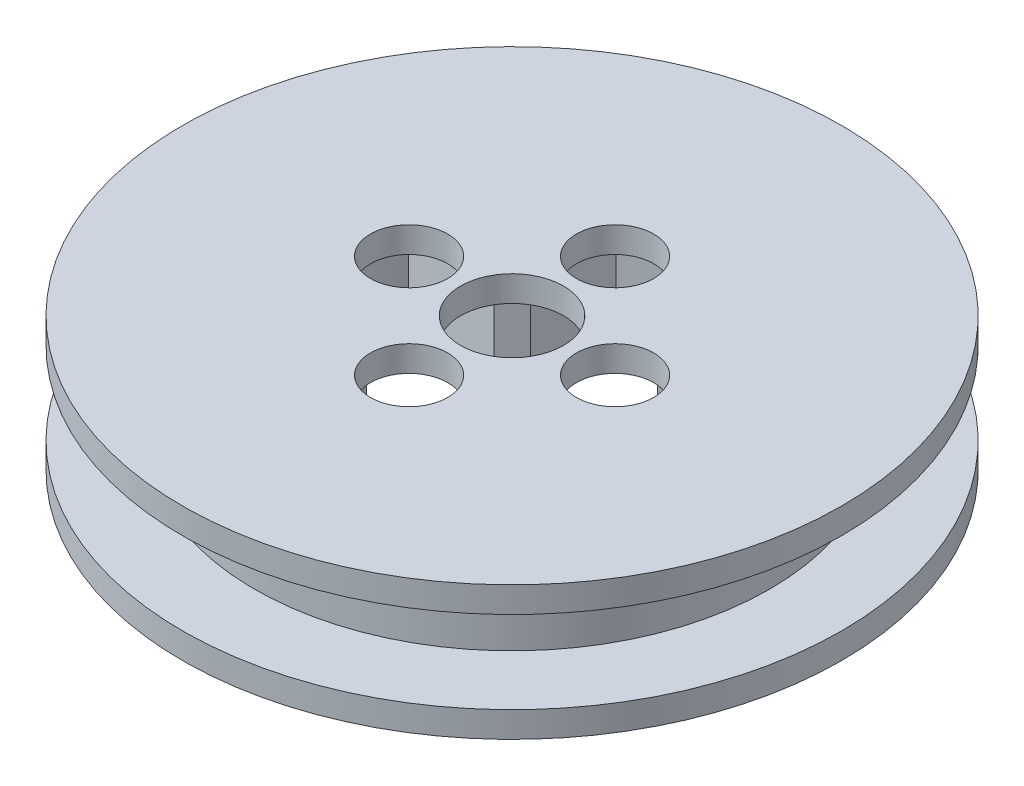
ISO-10303-21;
HEADER;
FILE_DESCRIPTION(('STEP AP214'),'2;1');
FILE_NAME('part.step','',(''),(''),'','','');
FILE_SCHEMA(('AUTOMOTIVE_DESIGN { 1 0 10303 214 1 1 1 1 }'));
ENDSEC;
DATA;
#1=APPLICATION_CONTEXT('core data for automotive mechanical design processes');
#2=APPLICATION_PROTOCOL_DEFINITION('international standard','automotive_design',2000,#1);
#3=PRODUCT_CONTEXT('',#1,'mechanical');
#4=PRODUCT('Part','Part','',(#3));
#5=PRODUCT_RELATED_PRODUCT_CATEGORY('part','',(#4));
#6=PRODUCT_DEFINITION_FORMATION('','',#4);
#7=PRODUCT_DEFINITION_CONTEXT('part definition',#1,'design');
#8=PRODUCT_DEFINITION('design','',#6,#7);
#9=PRODUCT_DEFINITION_SHAPE('','',#8);
#10=(LENGTH_UNIT() NAMED_UNIT(*) SI_UNIT(.MILLI.,.METRE.));
#11=(NAMED_UNIT(*) PLANE_ANGLE_UNIT() SI_UNIT($,.RADIAN.));
#12=(NAMED_UNIT(*) SI_UNIT($,.STERADIAN.) SOLID_ANGLE_UNIT());
#13=UNCERTAINTY_MEASURE_WITH_UNIT(LENGTH_MEASURE(1.E-05),#10,'distance_accuracy_value','');
#14=(GEOMETRIC_REPRESENTATION_CONTEXT(3) GLOBAL_UNCERTAINTY_ASSIGNED_CONTEXT((#13)) GLOBAL_UNIT_ASSIGNED_CONTEXT((#10,
#11,#12)) REPRESENTATION_CONTEXT('',''));
#15=CARTESIAN_POINT('',(0.,0.,0.));
#16=DIRECTION('',(0.,0.,1.));
#17=DIRECTION('',(1.,0.,0.));
#18=AXIS2_PLACEMENT_3D('',#15,#16,#17);
#19=CARTESIAN_POINT('',(64.8025652840579,-6.22836410779435,12.446906686032));
#20=DIRECTION('',(0.,-1.,0.));
#21=DIRECTION('',(1.,0.,0.));
#22=AXIS2_PLACEMENT_3D('',#19,#20,#21);
#23=PLANE('',#22);
#24=CARTESIAN_POINT('',(64.8025652840579,-6.22836410779435,12.446906686032));
#25=DIRECTION('',(0.,-1.,0.));
#26=DIRECTION('',(1.,0.,0.));
#27=AXIS2_PLACEMENT_3D('',#24,#25,#26);
#28=CIRCLE('',#27,3.175);
#29=CARTESIAN_POINT('',(67.9775652840579,-6.22836410779435,12.446906686032));
#30=VERTEX_POINT('',#29);
#31=EDGE_CURVE('E289',#30,#30,#28,.T.);
#32=ORIENTED_EDGE('',*,*,#31,.F.);
#33=EDGE_LOOP('',(#32));
#34=FACE_BOUND('',#33,.T.);
#35=CARTESIAN_POINT('',(64.8025652840579,-6.22836410779435,18.796906686032));
#36=DIRECTION('',(0.,-1.,0.));
#37=DIRECTION('',(1.,0.,0.));
#38=AXIS2_PLACEMENT_3D('',#35,#36,#37);
#39=CIRCLE('',#38,2.38125000000001);
#40=CARTESIAN_POINT('',(67.1838152840579,-6.22836410779435,18.796906686032));
#41=VERTEX_POINT('',#40);
#42=EDGE_CURVE('E301',#41,#41,#39,.T.);
#43=ORIENTED_EDGE('',*,*,#42,.F.);
#44=EDGE_LOOP('',(#43));
#45=FACE_BOUND('',#44,.T.);
#46=CARTESIAN_POINT('',(58.4525652840579,-6.22836410779435,12.446906686032));
#47=DIRECTION('',(0.,-1.,0.));
#48=DIRECTION('',(1.,0.,0.));
#49=AXIS2_PLACEMENT_3D('',#46,#47,#48);
#50=CIRCLE('',#49,2.38125);
#51=CARTESIAN_POINT('',(60.8338152840579,-6.22836410779435,12.446906686032));
#52=VERTEX_POINT('',#51);
#53=EDGE_CURVE('E313',#52,#52,#50,.T.);
#54=ORIENTED_EDGE('',*,*,#53,.F.);
#55=EDGE_LOOP('',(#54));
#56=FACE_BOUND('',#55,.T.);
#57=CARTESIAN_POINT('',(71.1525652840579,-6.22836410779435,12.446906686032));
#58=DIRECTION('',(0.,-1.,0.));
#59=DIRECTION('',(1.,0.,0.));
#60=AXIS2_PLACEMENT_3D('',#57,#58,#59);
#61=CIRCLE('',#60,2.38125000000001);
#62=CARTESIAN_POINT('',(73.5338152840579,-6.22836410779435,12.446906686032));
#63=VERTEX_POINT('',#62);
#64=EDGE_CURVE('E307',#63,#63,#61,.T.);
#65=ORIENTED_EDGE('',*,*,#64,.F.);
#66=EDGE_LOOP('',(#65));
#67=FACE_BOUND('',#66,.T.);
#68=CARTESIAN_POINT('',(64.8025652840579,-6.22836410779435,6.09690668603199));
#69=DIRECTION('',(0.,-1.,0.));
#70=DIRECTION('',(1.,0.,0.));
#71=AXIS2_PLACEMENT_3D('',#68,#69,#70);
#72=CIRCLE('',#71,2.38125000000001);
#73=CARTESIAN_POINT('',(67.1838152840579,-6.22836410779435,6.09690668603199));
#74=VERTEX_POINT('',#73);
#75=EDGE_CURVE('E295',#74,#74,#72,.T.);
#76=ORIENTED_EDGE('',*,*,#75,.F.);
#77=EDGE_LOOP('',(#76));
#78=FACE_BOUND('',#77,.T.);
#79=DIRECTION('',(-0.70710678118655,0.,0.707106781186545));
#80=VECTOR('',#79,1.);
#81=CARTESIAN_POINT('',(60.8737032310902,-6.22836410779435,7.39551261793057));
#82=LINE('',#81,#80);
#83=CARTESIAN_POINT('',(60.8737032310902,-6.22836410779435,7.39551261793057));
#84=VERTEX_POINT('',#83);
#85=CARTESIAN_POINT('',(59.7511712159565,-6.22836410779435,8.5180446330642));
#86=VERTEX_POINT('',#85);
#87=EDGE_CURVE('E54',#84,#86,#82,.T.);
#88=ORIENTED_EDGE('',*,*,#87,.F.);
#89=DIRECTION('',(0.258819045102516,0.,0.96592582628907));
#90=VECTOR('',#89,1.);
#91=CARTESIAN_POINT('',(58.94207584145,-6.22836410779435,0.186581058501487));
#92=LINE('',#91,#90);
#93=CARTESIAN_POINT('',(58.94207584145,-6.22836410779435,0.186581058501485));
#94=VERTEX_POINT('',#93);
#95=EDGE_CURVE('E176',#94,#84,#92,.T.);
#96=ORIENTED_EDGE('',*,*,#95,.F.);
#97=CARTESIAN_POINT('',(64.8025652840579,-6.22836410779435,12.446906686032));
#98=DIRECTION('',(0.,-1.,0.));
#99=DIRECTION('',(1.,0.,0.));
#100=AXIS2_PLACEMENT_3D('',#97,#98,#99);
#101=CIRCLE('',#100,13.589);
#102=CARTESIAN_POINT('',(70.663054726666,-6.22836410779435,0.186581058501565));
#103=VERTEX_POINT('',#102);
#104=EDGE_CURVE('E285',#94,#103,#101,.T.);
#105=ORIENTED_EDGE('',*,*,#104,.T.);
#106=DIRECTION('',(0.258819045102529,0.,-0.965925826289066));
#107=VECTOR('',#106,1.);
#108=CARTESIAN_POINT('',(68.7314273370257,-6.22836410779435,7.39551261793062));
#109=LINE('',#108,#107);
#110=CARTESIAN_POINT('',(68.7314273370257,-6.22836410779435,7.39551261793062));
#111=VERTEX_POINT('',#110);
#112=EDGE_CURVE('E185',#111,#103,#109,.T.);
#113=ORIENTED_EDGE('',*,*,#112,.F.);
#114=DIRECTION('',(-0.707106781186551,0.,-0.707106781186544));
#115=VECTOR('',#114,1.);
#116=CARTESIAN_POINT('',(69.8539593521593,-6.22836410779435,8.51804463306426));
#117=LINE('',#116,#115);
#118=CARTESIAN_POINT('',(69.8539593521593,-6.22836410779435,8.51804463306426));
#119=VERTEX_POINT('',#118);
#120=EDGE_CURVE('E190',#119,#111,#117,.T.);
#121=ORIENTED_EDGE('',*,*,#120,.F.);
#122=DIRECTION('',(-0.965925826289069,0.,0.258819045102517));
#123=VECTOR('',#122,1.);
#124=CARTESIAN_POINT('',(77.0628909115884,-6.22836410779435,6.58641724342404));
#125=LINE('',#124,#123);
#126=CARTESIAN_POINT('',(77.0628909115884,-6.22836410779435,6.58641724342405));
#127=VERTEX_POINT('',#126);
#128=EDGE_CURVE('E194',#127,#119,#125,.T.);
#129=ORIENTED_EDGE('',*,*,#128,.F.);
#130=CARTESIAN_POINT('',(77.0628909115883,-6.22836410779435,18.3073961286401));
#131=VERTEX_POINT('',#130);
#132=EDGE_CURVE('E634',#127,#131,#101,.T.);
#133=ORIENTED_EDGE('',*,*,#132,.T.);
#134=DIRECTION('',(0.965925826289067,0.,0.258819045102527));
#135=VECTOR('',#134,1.);
#136=CARTESIAN_POINT('',(69.8539593521593,-6.22836410779435,16.3757687389998));
#137=LINE('',#136,#135);
#138=CARTESIAN_POINT('',(69.8539593521593,-6.22836410779435,16.3757687389998));
#139=VERTEX_POINT('',#138);
#140=EDGE_CURVE('E212',#139,#131,#137,.T.);
#141=ORIENTED_EDGE('',*,*,#140,.F.);
#142=DIRECTION('',(0.707106781186547,0.,-0.707106781186547));
#143=VECTOR('',#142,1.);
#144=CARTESIAN_POINT('',(68.7314273370256,-6.22836410779435,17.4983007541334));
#145=LINE('',#144,#143);
#146=CARTESIAN_POINT('',(68.7314273370256,-6.22836410779435,17.4983007541334));
#147=VERTEX_POINT('',#146);
#148=EDGE_CURVE('E217',#147,#139,#145,.T.);
#149=ORIENTED_EDGE('',*,*,#148,.F.);
#150=DIRECTION('',(-0.258819045102516,0.,-0.96592582628907));
#151=VECTOR('',#150,1.);
#152=CARTESIAN_POINT('',(70.6630547266658,-6.22836410779435,24.7072323135625));
#153=LINE('',#152,#151);
#154=CARTESIAN_POINT('',(70.6630547266658,-6.22836410779435,24.7072323135625));
#155=VERTEX_POINT('',#154);
#156=EDGE_CURVE('E221',#155,#147,#153,.T.);
#157=ORIENTED_EDGE('',*,*,#156,.F.);
#158=CARTESIAN_POINT('',(58.9420758414498,-6.22836410779435,24.7072323135624));
#159=VERTEX_POINT('',#158);
#160=EDGE_CURVE('E279',#155,#159,#101,.T.);
#161=ORIENTED_EDGE('',*,*,#160,.T.);
#162=DIRECTION('',(-0.258819045102528,0.,0.965925826289066));
#163=VECTOR('',#162,1.);
#164=CARTESIAN_POINT('',(60.8737032310901,-6.22836410779435,17.4983007541334));
#165=LINE('',#164,#163);
#166=CARTESIAN_POINT('',(60.8737032310901,-6.22836410779435,17.4983007541334));
#167=VERTEX_POINT('',#166);
#168=EDGE_CURVE('E242',#167,#159,#165,.T.);
#169=ORIENTED_EDGE('',*,*,#168,.F.);
#170=DIRECTION('',(0.707106781186544,0.,0.707106781186551));
#171=VECTOR('',#170,1.);
#172=CARTESIAN_POINT('',(59.7511712159565,-6.22836410779435,16.3757687389997));
#173=LINE('',#172,#171);
#174=CARTESIAN_POINT('',(59.7511712159565,-6.22836410779435,16.3757687389997));
#175=VERTEX_POINT('',#174);
#176=EDGE_CURVE('E247',#175,#167,#173,.T.);
#177=ORIENTED_EDGE('',*,*,#176,.F.);
#178=DIRECTION('',(0.965925826289069,0.,-0.258819045102517));
#179=VECTOR('',#178,1.);
#180=CARTESIAN_POINT('',(52.5422396565274,-6.22836410779435,18.3073961286399));
#181=LINE('',#180,#179);
#182=CARTESIAN_POINT('',(52.5422396565274,-6.22836410779435,18.3073961286399));
#183=VERTEX_POINT('',#182);
#184=EDGE_CURVE('E251',#183,#175,#181,.T.);
#185=ORIENTED_EDGE('',*,*,#184,.F.);
#186=CARTESIAN_POINT('',(52.5422396565275,-6.22836410779435,6.58641724342388));
#187=VERTEX_POINT('',#186);
#188=EDGE_CURVE('E282',#183,#187,#101,.T.);
#189=ORIENTED_EDGE('',*,*,#188,.T.);
#190=DIRECTION('',(-0.965925826289066,0.,-0.258819045102528));
#191=VECTOR('',#190,1.);
#192=CARTESIAN_POINT('',(59.7511712159565,-6.22836410779435,8.5180446330642));
#193=LINE('',#192,#191);
#194=EDGE_CURVE('E59',#86,#187,#193,.T.);
#195=ORIENTED_EDGE('',*,*,#194,.F.);
#196=EDGE_LOOP('',(#88,#96,#105,#113,#121,#129,#133,#141,#149,#157,#161,#169,#177,#185,#189,#195));
#197=FACE_BOUND('',#196,.T.);
#198=ADVANCED_FACE('F37',(#34,#45,#56,#67,#78,#197),#23,.T.);
#199=CARTESIAN_POINT('',(64.8025652840579,-11.3083641077944,12.446906686032));
#200=DIRECTION('',(0.,1.,0.));
#201=DIRECTION('',(-1.,0.,0.));
#202=AXIS2_PLACEMENT_3D('',#199,#200,#201);
#203=CYLINDRICAL_SURFACE('',#202,13.589);
#204=ORIENTED_EDGE('',*,*,#104,.F.);
#205=DIRECTION('',(0.,1.,0.));
#206=VECTOR('',#205,1.);
#207=CARTESIAN_POINT('',(58.94207584145,-24.6783328893584,0.186581058501487));
#208=LINE('',#207,#206);
#209=CARTESIAN_POINT('',(58.94207584145,-12.8958641077944,0.186581058501487));
#210=VERTEX_POINT('',#209);
#211=EDGE_CURVE('E179',#210,#94,#208,.T.);
#212=ORIENTED_EDGE('',*,*,#211,.F.);
#213=CARTESIAN_POINT('',(64.8025652840579,-12.8958641077944,12.446906686032));
#214=DIRECTION('',(0.,-1.,0.));
#215=DIRECTION('',(1.,0.,0.));
#216=AXIS2_PLACEMENT_3D('',#213,#214,#215);
#217=CIRCLE('',#216,13.589);
#218=CARTESIAN_POINT('',(70.663054726666,-12.8958641077944,0.186581058501561));
#219=VERTEX_POINT('',#218);
#220=EDGE_CURVE('E275',#210,#219,#217,.T.);
#221=ORIENTED_EDGE('',*,*,#220,.T.);
#222=DIRECTION('',(0.,1.,0.));
#223=VECTOR('',#222,1.);
#224=CARTESIAN_POINT('',(70.663054726666,-24.6783328893584,0.186581058501573));
#225=LINE('',#224,#223);
#226=EDGE_CURVE('E169',#219,#103,#225,.T.);
#227=ORIENTED_EDGE('',*,*,#226,.T.);
#228=EDGE_LOOP('',(#204,#212,#221,#227));
#229=FACE_BOUND('',#228,.T.);
#230=ADVANCED_FACE('F354',(#229),#203,.F.);
#231=CARTESIAN_POINT('',(52.5422396565274,-12.8958641077944,18.3073961286399));
#232=VERTEX_POINT('',#231);
#233=CARTESIAN_POINT('',(52.5422396565275,-12.8958641077944,6.58641724342389));
#234=VERTEX_POINT('',#233);
#235=EDGE_CURVE('E272',#232,#234,#217,.T.);
#236=ORIENTED_EDGE('',*,*,#235,.T.);
#237=DIRECTION('',(0.,1.,0.));
#238=VECTOR('',#237,1.);
#239=CARTESIAN_POINT('',(52.5422396565275,-24.6783328893584,6.58641724342389));
#240=LINE('',#239,#238);
#241=EDGE_CURVE('E162',#234,#187,#240,.T.);
#242=ORIENTED_EDGE('',*,*,#241,.T.);
#243=ORIENTED_EDGE('',*,*,#188,.F.);
#244=DIRECTION('',(0.,1.,0.));
#245=VECTOR('',#244,1.);
#246=CARTESIAN_POINT('',(52.5422396565274,-24.6783328893584,18.3073961286399));
#247=LINE('',#246,#245);
#248=EDGE_CURVE('E254',#232,#183,#247,.T.);
#249=ORIENTED_EDGE('',*,*,#248,.F.);
#250=EDGE_LOOP('',(#236,#242,#243,#249));
#251=FACE_BOUND('',#250,.T.);
#252=ADVANCED_FACE('F360',(#251),#203,.F.);
#253=ORIENTED_EDGE('',*,*,#132,.F.);
#254=DIRECTION('',(0.,1.,0.));
#255=VECTOR('',#254,1.);
#256=CARTESIAN_POINT('',(77.0628909115884,-24.6783328893584,6.58641724342404));
#257=LINE('',#256,#255);
#258=CARTESIAN_POINT('',(77.0628909115884,-12.8958641077944,6.58641724342404));
#259=VERTEX_POINT('',#258);
#260=EDGE_CURVE('E172',#259,#127,#257,.T.);
#261=ORIENTED_EDGE('',*,*,#260,.F.);
#262=CARTESIAN_POINT('',(77.0628909115883,-12.8958641077944,18.3073961286401));
#263=VERTEX_POINT('',#262);
#264=EDGE_CURVE('E628',#259,#263,#217,.T.);
#265=ORIENTED_EDGE('',*,*,#264,.T.);
#266=DIRECTION('',(0.,1.,0.));
#267=VECTOR('',#266,1.);
#268=CARTESIAN_POINT('',(77.0628909115883,-24.6783328893584,18.3073961286401));
#269=LINE('',#268,#267);
#270=EDGE_CURVE('E200',#263,#131,#269,.T.);
#271=ORIENTED_EDGE('',*,*,#270,.T.);
#272=EDGE_LOOP('',(#253,#261,#265,#271));
#273=FACE_BOUND('',#272,.T.);
#274=ADVANCED_FACE('F372',(#273),#203,.F.);
#275=ORIENTED_EDGE('',*,*,#160,.F.);
#276=DIRECTION('',(0.,1.,0.));
#277=VECTOR('',#276,1.);
#278=CARTESIAN_POINT('',(70.6630547266658,-24.6783328893584,24.7072323135625));
#279=LINE('',#278,#277);
#280=CARTESIAN_POINT('',(70.6630547266658,-12.8958641077944,24.7072323135625));
#281=VERTEX_POINT('',#280);
#282=EDGE_CURVE('E224',#281,#155,#279,.T.);
#283=ORIENTED_EDGE('',*,*,#282,.F.);
#284=CARTESIAN_POINT('',(58.9420758414498,-12.8958641077944,24.7072323135624));
#285=VERTEX_POINT('',#284);
#286=EDGE_CURVE('E258',#281,#285,#217,.T.);
#287=ORIENTED_EDGE('',*,*,#286,.T.);
#288=DIRECTION('',(0.,1.,0.));
#289=VECTOR('',#288,1.);
#290=CARTESIAN_POINT('',(58.9420758414498,-24.6783328893584,24.7072323135624));
#291=LINE('',#290,#289);
#292=EDGE_CURVE('E228',#285,#159,#291,.T.);
#293=ORIENTED_EDGE('',*,*,#292,.T.);
#294=EDGE_LOOP('',(#275,#283,#287,#293));
#295=FACE_BOUND('',#294,.T.);
#296=ADVANCED_FACE('F363',(#295),#203,.F.);
#297=CARTESIAN_POINT('',(64.8025652840579,-6.22836410779435,12.446906686032));
#298=DIRECTION('',(0.,-1.,0.));
#299=DIRECTION('',(1.,0.,0.));
#300=AXIS2_PLACEMENT_3D('',#297,#298,#299);
#301=CIRCLE('',#300,15.875);
#302=CARTESIAN_POINT('',(80.6775652840579,-6.22836410779435,12.446906686032));
#303=VERTEX_POINT('',#302);
#304=EDGE_CURVE('E11',#303,#303,#301,.T.);
#305=ORIENTED_EDGE('',*,*,#304,.F.);
#306=EDGE_LOOP('',(#305));
#307=FACE_BOUND('',#306,.T.);
#308=CARTESIAN_POINT('',(64.8025652840579,-6.22836410779435,12.446906686032));
#309=DIRECTION('',(0.,-1.,0.));
#310=DIRECTION('',(1.,0.,0.));
#311=AXIS2_PLACEMENT_3D('',#308,#309,#310);
#312=CIRCLE('',#311,20.32);
#313=CARTESIAN_POINT('',(85.1225652840579,-6.22836410779435,12.446906686032));
#314=VERTEX_POINT('',#313);
#315=EDGE_CURVE('E46',#314,#314,#312,.T.);
#316=ORIENTED_EDGE('',*,*,#315,.T.);
#317=EDGE_LOOP('',(#316));
#318=FACE_BOUND('',#317,.T.);
#319=ADVANCED_FACE('F327',(#307,#318),#23,.T.);
#320=CARTESIAN_POINT('',(64.8025652840579,-4.64086410779435,12.446906686032));
#321=DIRECTION('',(0.,-1.,0.));
#322=DIRECTION('',(1.,0.,0.));
#323=AXIS2_PLACEMENT_3D('',#320,#321,#322);
#324=PLANE('',#323);
#325=CARTESIAN_POINT('',(64.8025652840579,-4.64086410779435,12.446906686032));
#326=DIRECTION('',(0.,-1.,0.));
#327=DIRECTION('',(1.,0.,0.));
#328=AXIS2_PLACEMENT_3D('',#325,#326,#327);
#329=CIRCLE('',#328,20.32);
#330=CARTESIAN_POINT('',(85.1225652840579,-4.64086410779435,12.446906686032));
#331=VERTEX_POINT('',#330);
#332=EDGE_CURVE('E41',#331,#331,#329,.T.);
#333=ORIENTED_EDGE('',*,*,#332,.F.);
#334=EDGE_LOOP('',(#333));
#335=FACE_BOUND('',#334,.T.);
#336=CARTESIAN_POINT('',(58.4525652840579,-4.64086410779435,12.446906686032));
#337=DIRECTION('',(0.,-1.,0.));
#338=DIRECTION('',(1.,0.,0.));
#339=AXIS2_PLACEMENT_3D('',#336,#337,#338);
#340=CIRCLE('',#339,2.38125);
#341=CARTESIAN_POINT('',(60.8338152840579,-4.64086410779435,12.446906686032));
#342=VERTEX_POINT('',#341);
#343=EDGE_CURVE('E310',#342,#342,#340,.T.);
#344=ORIENTED_EDGE('',*,*,#343,.T.);
#345=EDGE_LOOP('',(#344));
#346=FACE_BOUND('',#345,.T.);
#347=CARTESIAN_POINT('',(71.1525652840579,-4.64086410779435,12.446906686032));
#348=DIRECTION('',(0.,-1.,0.));
#349=DIRECTION('',(1.,0.,0.));
#350=AXIS2_PLACEMENT_3D('',#347,#348,#349);
#351=CIRCLE('',#350,2.38125000000001);
#352=CARTESIAN_POINT('',(73.5338152840579,-4.64086410779435,12.446906686032));
#353=VERTEX_POINT('',#352);
#354=EDGE_CURVE('E304',#353,#353,#351,.T.);
#355=ORIENTED_EDGE('',*,*,#354,.T.);
#356=EDGE_LOOP('',(#355));
#357=FACE_BOUND('',#356,.T.);
#358=CARTESIAN_POINT('',(64.8025652840579,-4.64086410779435,18.796906686032));
#359=DIRECTION('',(0.,-1.,0.));
#360=DIRECTION('',(1.,0.,0.));
#361=AXIS2_PLACEMENT_3D('',#358,#359,#360);
#362=CIRCLE('',#361,2.38125000000001);
#363=CARTESIAN_POINT('',(67.1838152840579,-4.64086410779435,18.796906686032));
#364=VERTEX_POINT('',#363);
#365=EDGE_CURVE('E298',#364,#364,#362,.T.);
#366=ORIENTED_EDGE('',*,*,#365,.T.);
#367=EDGE_LOOP('',(#366));
#368=FACE_BOUND('',#367,.T.);
#369=CARTESIAN_POINT('',(64.8025652840579,-4.64086410779435,6.09690668603199));
#370=DIRECTION('',(0.,-1.,0.));
#371=DIRECTION('',(1.,0.,0.));
#372=AXIS2_PLACEMENT_3D('',#369,#370,#371);
#373=CIRCLE('',#372,2.38125000000001);
#374=CARTESIAN_POINT('',(67.1838152840579,-4.64086410779435,6.09690668603199));
#375=VERTEX_POINT('',#374);
#376=EDGE_CURVE('E292',#375,#375,#373,.T.);
#377=ORIENTED_EDGE('',*,*,#376,.T.);
#378=EDGE_LOOP('',(#377));
#379=FACE_BOUND('',#378,.T.);
#380=CARTESIAN_POINT('',(64.8025652840579,-4.64086410779435,12.446906686032));
#381=DIRECTION('',(0.,-1.,0.));
#382=DIRECTION('',(1.,0.,0.));
#383=AXIS2_PLACEMENT_3D('',#380,#381,#382);
#384=CIRCLE('',#383,3.175);
#385=CARTESIAN_POINT('',(67.9775652840579,-4.64086410779435,12.446906686032));
#386=VERTEX_POINT('',#385);
#387=EDGE_CURVE('E287',#386,#386,#384,.T.);
#388=ORIENTED_EDGE('',*,*,#387,.T.);
#389=EDGE_LOOP('',(#388));
#390=FACE_BOUND('',#389,.T.);
#391=ADVANCED_FACE('F324',(#335,#346,#357,#368,#379,#390),#324,.F.);
#392=CARTESIAN_POINT('',(64.8025652840579,-6.22836410779435,12.446906686032));
#393=DIRECTION('',(0.,1.,0.));
#394=DIRECTION('',(-1.,0.,0.));
#395=AXIS2_PLACEMENT_3D('',#392,#393,#394);
#396=CYLINDRICAL_SURFACE('',#395,20.32);
#397=ORIENTED_EDGE('',*,*,#315,.F.);
#398=EDGE_LOOP('',(#397));
#399=FACE_BOUND('',#398,.T.);
#400=ORIENTED_EDGE('',*,*,#332,.T.);
#401=EDGE_LOOP('',(#400));
#402=FACE_BOUND('',#401,.T.);
#403=ADVANCED_FACE('F39',(#399,#402),#396,.T.);
#404=CARTESIAN_POINT('',(58.4525652840579,-6.22836410779435,12.446906686032));
#405=DIRECTION('',(0.,1.,0.));
#406=DIRECTION('',(-1.,0.,0.));
#407=AXIS2_PLACEMENT_3D('',#404,#405,#406);
#408=CYLINDRICAL_SURFACE('',#407,2.38125);
#409=ORIENTED_EDGE('',*,*,#53,.T.);
#410=EDGE_LOOP('',(#409));
#411=FACE_BOUND('',#410,.T.);
#412=ORIENTED_EDGE('',*,*,#343,.F.);
#413=EDGE_LOOP('',(#412));
#414=FACE_BOUND('',#413,.T.);
#415=ADVANCED_FACE('F533',(#411,#414),#408,.F.);
#416=CARTESIAN_POINT('',(71.1525652840579,-6.22836410779435,12.446906686032));
#417=DIRECTION('',(0.,1.,0.));
#418=DIRECTION('',(-1.,0.,0.));
#419=AXIS2_PLACEMENT_3D('',#416,#417,#418);
#420=CYLINDRICAL_SURFACE('',#419,2.38125000000001);
#421=ORIENTED_EDGE('',*,*,#64,.T.);
#422=EDGE_LOOP('',(#421));
#423=FACE_BOUND('',#422,.T.);
#424=ORIENTED_EDGE('',*,*,#354,.F.);
#425=EDGE_LOOP('',(#424));
#426=FACE_BOUND('',#425,.T.);
#427=ADVANCED_FACE('F523',(#423,#426),#420,.F.);
#428=CARTESIAN_POINT('',(64.8025652840579,-6.22836410779435,18.796906686032));
#429=DIRECTION('',(0.,1.,0.));
#430=DIRECTION('',(-1.,0.,0.));
#431=AXIS2_PLACEMENT_3D('',#428,#429,#430);
#432=CYLINDRICAL_SURFACE('',#431,2.38125000000001);
#433=ORIENTED_EDGE('',*,*,#42,.T.);
#434=EDGE_LOOP('',(#433));
#435=FACE_BOUND('',#434,.T.);
#436=ORIENTED_EDGE('',*,*,#365,.F.);
#437=EDGE_LOOP('',(#436));
#438=FACE_BOUND('',#437,.T.);
#439=ADVANCED_FACE('F350',(#435,#438),#432,.F.);
#440=CARTESIAN_POINT('',(64.8025652840579,-6.22836410779435,6.09690668603199));
#441=DIRECTION('',(0.,1.,0.));
#442=DIRECTION('',(-1.,0.,0.));
#443=AXIS2_PLACEMENT_3D('',#440,#441,#442);
#444=CYLINDRICAL_SURFACE('',#443,2.38125000000001);
#445=ORIENTED_EDGE('',*,*,#75,.T.);
#446=EDGE_LOOP('',(#445));
#447=FACE_BOUND('',#446,.T.);
#448=ORIENTED_EDGE('',*,*,#376,.F.);
#449=EDGE_LOOP('',(#448));
#450=FACE_BOUND('',#449,.T.);
#451=ADVANCED_FACE('F341',(#447,#450),#444,.F.);
#452=CARTESIAN_POINT('',(64.8025652840579,-6.22836410779435,12.446906686032));
#453=DIRECTION('',(0.,1.,0.));
#454=DIRECTION('',(-1.,0.,0.));
#455=AXIS2_PLACEMENT_3D('',#452,#453,#454);
#456=CYLINDRICAL_SURFACE('',#455,3.175);
#457=ORIENTED_EDGE('',*,*,#31,.T.);
#458=EDGE_LOOP('',(#457));
#459=FACE_BOUND('',#458,.T.);
#460=ORIENTED_EDGE('',*,*,#387,.F.);
#461=EDGE_LOOP('',(#460));
#462=FACE_BOUND('',#461,.T.);
#463=ADVANCED_FACE('F338',(#459,#462),#456,.F.);
#464=CARTESIAN_POINT('',(64.8025652840579,-11.3083641077944,12.446906686032));
#465=DIRECTION('',(0.,1.,0.));
#466=DIRECTION('',(-1.,0.,0.));
#467=AXIS2_PLACEMENT_3D('',#464,#465,#466);
#468=CYLINDRICAL_SURFACE('',#467,15.875);
#469=CARTESIAN_POINT('',(64.8025652840579,-11.3083641077944,12.446906686032));
#470=DIRECTION('',(0.,-1.,0.));
#471=DIRECTION('',(1.,0.,0.));
#472=AXIS2_PLACEMENT_3D('',#469,#470,#471);
#473=CIRCLE('',#472,15.875);
#474=CARTESIAN_POINT('',(80.6775652840579,-11.3083641077944,12.446906686032));
#475=VERTEX_POINT('',#474);
#476=EDGE_CURVE('E284',#475,#475,#473,.T.);
#477=ORIENTED_EDGE('',*,*,#476,.F.);
#478=EDGE_LOOP('',(#477));
#479=FACE_BOUND('',#478,.T.);
#480=ORIENTED_EDGE('',*,*,#304,.T.);
#481=EDGE_LOOP('',(#480));
#482=FACE_BOUND('',#481,.T.);
#483=ADVANCED_FACE('F340',(#479,#482),#468,.T.);
#484=CARTESIAN_POINT('',(64.8025652840579,-12.8958641077944,12.446906686032));
#485=DIRECTION('',(0.,-1.,0.));
#486=DIRECTION('',(1.,0.,0.));
#487=AXIS2_PLACEMENT_3D('',#484,#485,#486);
#488=PLANE('',#487);
#489=CARTESIAN_POINT('',(64.8025652840579,-12.8958641077944,12.446906686032));
#490=DIRECTION('',(0.,-1.,0.));
#491=DIRECTION('',(1.,0.,0.));
#492=AXIS2_PLACEMENT_3D('',#489,#490,#491);
#493=CIRCLE('',#492,20.32);
#494=CARTESIAN_POINT('',(85.1225652840579,-12.8958641077944,12.446906686032));
#495=VERTEX_POINT('',#494);
#496=EDGE_CURVE('E276',#495,#495,#493,.T.);
#497=ORIENTED_EDGE('',*,*,#496,.T.);
#498=EDGE_LOOP('',(#497));
#499=FACE_BOUND('',#498,.T.);
#500=ORIENTED_EDGE('',*,*,#235,.F.);
#501=DIRECTION('',(0.965925826289069,0.,-0.258819045102517));
#502=VECTOR('',#501,1.);
#503=CARTESIAN_POINT('',(52.5422396565274,-12.8958641077944,18.3073961286399));
#504=LINE('',#503,#502);
#505=CARTESIAN_POINT('',(59.7511712159565,-12.8958641077944,16.3757687389997));
#506=VERTEX_POINT('',#505);
#507=EDGE_CURVE('E259',#232,#506,#504,.T.);
#508=ORIENTED_EDGE('',*,*,#507,.T.);
#509=DIRECTION('',(0.707106781186544,0.,0.707106781186551));
#510=VECTOR('',#509,1.);
#511=CARTESIAN_POINT('',(59.7511712159565,-12.8958641077944,16.3757687389997));
#512=LINE('',#511,#510);
#513=CARTESIAN_POINT('',(60.8737032310901,-12.8958641077944,17.4983007541334));
#514=VERTEX_POINT('',#513);
#515=EDGE_CURVE('E255',#506,#514,#512,.T.);
#516=ORIENTED_EDGE('',*,*,#515,.T.);
#517=DIRECTION('',(-0.258819045102528,0.,0.965925826289067));
#518=VECTOR('',#517,1.);
#519=CARTESIAN_POINT('',(60.8737032310901,-12.8958641077944,17.4983007541334));
#520=LINE('',#519,#518);
#521=EDGE_CURVE('E245',#514,#285,#520,.T.);
#522=ORIENTED_EDGE('',*,*,#521,.T.);
#523=ORIENTED_EDGE('',*,*,#286,.F.);
#524=DIRECTION('',(-0.258819045102516,0.,-0.96592582628907));
#525=VECTOR('',#524,1.);
#526=CARTESIAN_POINT('',(70.6630547266658,-12.8958641077944,24.7072323135625));
#527=LINE('',#526,#525);
#528=CARTESIAN_POINT('',(68.7314273370256,-12.8958641077944,17.4983007541334));
#529=VERTEX_POINT('',#528);
#530=EDGE_CURVE('E229',#281,#529,#527,.T.);
#531=ORIENTED_EDGE('',*,*,#530,.T.);
#532=DIRECTION('',(0.707106781186548,0.,-0.707106781186548));
#533=VECTOR('',#532,1.);
#534=CARTESIAN_POINT('',(68.7314273370256,-12.8958641077944,17.4983007541334));
#535=LINE('',#534,#533);
#536=CARTESIAN_POINT('',(69.8539593521593,-12.8958641077944,16.3757687389998));
#537=VERTEX_POINT('',#536);
#538=EDGE_CURVE('E225',#529,#537,#535,.T.);
#539=ORIENTED_EDGE('',*,*,#538,.T.);
#540=DIRECTION('',(0.965925826289067,0.,0.258819045102527));
#541=VECTOR('',#540,1.);
#542=CARTESIAN_POINT('',(69.8539593521593,-12.8958641077944,16.3757687389998));
#543=LINE('',#542,#541);
#544=EDGE_CURVE('E215',#537,#263,#543,.T.);
#545=ORIENTED_EDGE('',*,*,#544,.T.);
#546=ORIENTED_EDGE('',*,*,#264,.F.);
#547=DIRECTION('',(-0.965925826289069,0.,0.258819045102517));
#548=VECTOR('',#547,1.);
#549=CARTESIAN_POINT('',(77.0628909115884,-12.8958641077944,6.58641724342404));
#550=LINE('',#549,#548);
#551=CARTESIAN_POINT('',(69.8539593521593,-12.8958641077944,8.51804463306426));
#552=VERTEX_POINT('',#551);
#553=EDGE_CURVE('E201',#259,#552,#550,.T.);
#554=ORIENTED_EDGE('',*,*,#553,.T.);
#555=DIRECTION('',(-0.707106781186551,0.,-0.707106781186544));
#556=VECTOR('',#555,1.);
#557=CARTESIAN_POINT('',(69.8539593521593,-12.8958641077944,8.51804463306426));
#558=LINE('',#557,#556);
#559=CARTESIAN_POINT('',(68.7314273370257,-12.8958641077944,7.39551261793062));
#560=VERTEX_POINT('',#559);
#561=EDGE_CURVE('E197',#552,#560,#558,.T.);
#562=ORIENTED_EDGE('',*,*,#561,.T.);
#563=DIRECTION('',(0.258819045102529,0.,-0.965925826289066));
#564=VECTOR('',#563,1.);
#565=CARTESIAN_POINT('',(68.7314273370257,-12.8958641077944,7.39551261793062));
#566=LINE('',#565,#564);
#567=EDGE_CURVE('E188',#560,#219,#566,.T.);
#568=ORIENTED_EDGE('',*,*,#567,.T.);
#569=ORIENTED_EDGE('',*,*,#220,.F.);
#570=DIRECTION('',(0.258819045102516,0.,0.96592582628907));
#571=VECTOR('',#570,1.);
#572=CARTESIAN_POINT('',(58.94207584145,-12.8958641077944,0.186581058501487));
#573=LINE('',#572,#571);
#574=CARTESIAN_POINT('',(60.8737032310902,-12.8958641077944,7.39551261793057));
#575=VERTEX_POINT('',#574);
#576=EDGE_CURVE('E164',#210,#575,#573,.T.);
#577=ORIENTED_EDGE('',*,*,#576,.T.);
#578=DIRECTION('',(-0.70710678118655,0.,0.707106781186545));
#579=VECTOR('',#578,1.);
#580=CARTESIAN_POINT('',(60.8737032310902,-12.8958641077944,7.39551261793057));
#581=LINE('',#580,#579);
#582=CARTESIAN_POINT('',(59.7511712159565,-12.8958641077944,8.5180446330642));
#583=VERTEX_POINT('',#582);
#584=EDGE_CURVE('E154',#575,#583,#581,.T.);
#585=ORIENTED_EDGE('',*,*,#584,.T.);
#586=DIRECTION('',(-0.965925826289066,0.,-0.258819045102528));
#587=VECTOR('',#586,1.);
#588=CARTESIAN_POINT('',(59.7511712159565,-12.8958641077944,8.5180446330642));
#589=LINE('',#588,#587);
#590=EDGE_CURVE('E160',#583,#234,#589,.T.);
#591=ORIENTED_EDGE('',*,*,#590,.T.);
#592=EDGE_LOOP('',(#500,#508,#516,#522,#523,#531,#539,#545,#546,#554,#562,#568,#569,#577,#585,#591));
#593=FACE_BOUND('',#592,.T.);
#594=ADVANCED_FACE('F167',(#499,#593),#488,.T.);
#595=CARTESIAN_POINT('',(64.8025652840579,-11.3083641077944,12.446906686032));
#596=DIRECTION('',(0.,-1.,0.));
#597=DIRECTION('',(1.,0.,0.));
#598=AXIS2_PLACEMENT_3D('',#595,#596,#597);
#599=PLANE('',#598);
#600=ORIENTED_EDGE('',*,*,#476,.T.);
#601=EDGE_LOOP('',(#600));
#602=FACE_BOUND('',#601,.T.);
#603=CARTESIAN_POINT('',(64.8025652840579,-11.3083641077944,12.446906686032));
#604=DIRECTION('',(0.,-1.,0.));
#605=DIRECTION('',(1.,0.,0.));
#606=AXIS2_PLACEMENT_3D('',#603,#604,#605);
#607=CIRCLE('',#606,20.32);
#608=CARTESIAN_POINT('',(85.1225652840579,-11.3083641077944,12.446906686032));
#609=VERTEX_POINT('',#608);
#610=EDGE_CURVE('E274',#609,#609,#607,.T.);
#611=ORIENTED_EDGE('',*,*,#610,.F.);
#612=EDGE_LOOP('',(#611));
#613=FACE_BOUND('',#612,.T.);
#614=ADVANCED_FACE('F386',(#602,#613),#599,.F.);
#615=CARTESIAN_POINT('',(64.8025652840579,-12.8958641077944,12.446906686032));
#616=DIRECTION('',(0.,1.,0.));
#617=DIRECTION('',(-1.,0.,0.));
#618=AXIS2_PLACEMENT_3D('',#615,#616,#617);
#619=CYLINDRICAL_SURFACE('',#618,20.32);
#620=ORIENTED_EDGE('',*,*,#496,.F.);
#621=EDGE_LOOP('',(#620));
#622=FACE_BOUND('',#621,.T.);
#623=ORIENTED_EDGE('',*,*,#610,.T.);
#624=EDGE_LOOP('',(#623));
#625=FACE_BOUND('',#624,.T.);
#626=ADVANCED_FACE('F382',(#622,#625),#619,.T.);
#627=CARTESIAN_POINT('',(52.5422396565274,-24.6783328893584,18.3073961286399));
#628=DIRECTION('',(0.258819045102517,0.,0.965925826289069));
#629=DIRECTION('',(0.965925826289069,0.,-0.258819045102517));
#630=AXIS2_PLACEMENT_3D('',#627,#628,#629);
#631=PLANE('',#630);
#632=ORIENTED_EDGE('',*,*,#507,.F.);
#633=ORIENTED_EDGE('',*,*,#248,.T.);
#634=ORIENTED_EDGE('',*,*,#184,.T.);
#635=DIRECTION('',(0.,1.,0.));
#636=VECTOR('',#635,1.);
#637=CARTESIAN_POINT('',(59.7511712159565,-24.6783328893584,16.3757687389997));
#638=LINE('',#637,#636);
#639=EDGE_CURVE('E250',#506,#175,#638,.T.);
#640=ORIENTED_EDGE('',*,*,#639,.F.);
#641=EDGE_LOOP('',(#632,#633,#634,#640));
#642=FACE_BOUND('',#641,.T.);
#643=ADVANCED_FACE('F385',(#642),#631,.F.);
#644=CARTESIAN_POINT('',(59.7511712159565,-24.6783328893584,16.3757687389997));
#645=DIRECTION('',(-0.707106781186551,0.,0.707106781186544));
#646=DIRECTION('',(0.707106781186544,0.,0.707106781186551));
#647=AXIS2_PLACEMENT_3D('',#644,#645,#646);
#648=PLANE('',#647);
#649=ORIENTED_EDGE('',*,*,#515,.F.);
#650=ORIENTED_EDGE('',*,*,#639,.T.);
#651=ORIENTED_EDGE('',*,*,#176,.T.);
#652=DIRECTION('',(0.,1.,0.));
#653=VECTOR('',#652,1.);
#654=CARTESIAN_POINT('',(60.8737032310901,-24.6783328893584,17.4983007541334));
#655=LINE('',#654,#653);
#656=EDGE_CURVE('E246',#514,#167,#655,.T.);
#657=ORIENTED_EDGE('',*,*,#656,.F.);
#658=EDGE_LOOP('',(#649,#650,#651,#657));
#659=FACE_BOUND('',#658,.T.);
#660=ADVANCED_FACE('F396',(#659),#648,.F.);
#661=CARTESIAN_POINT('',(60.8737032310901,-24.6783328893584,17.4983007541334));
#662=DIRECTION('',(-0.965925826289066,0.,-0.258819045102528));
#663=DIRECTION('',(-0.258819045102528,0.,0.965925826289067));
#664=AXIS2_PLACEMENT_3D('',#661,#662,#663);
#665=PLANE('',#664);
#666=ORIENTED_EDGE('',*,*,#521,.F.);
#667=ORIENTED_EDGE('',*,*,#656,.T.);
#668=ORIENTED_EDGE('',*,*,#168,.T.);
#669=ORIENTED_EDGE('',*,*,#292,.F.);
#670=EDGE_LOOP('',(#666,#667,#668,#669));
#671=FACE_BOUND('',#670,.T.);
#672=ADVANCED_FACE('F400',(#671),#665,.F.);
#673=CARTESIAN_POINT('',(70.6630547266658,-24.6783328893584,24.7072323135625));
#674=DIRECTION('',(0.96592582628907,0.,-0.258819045102516));
#675=DIRECTION('',(-0.258819045102516,0.,-0.96592582628907));
#676=AXIS2_PLACEMENT_3D('',#673,#674,#675);
#677=PLANE('',#676);
#678=ORIENTED_EDGE('',*,*,#530,.F.);
#679=ORIENTED_EDGE('',*,*,#282,.T.);
#680=ORIENTED_EDGE('',*,*,#156,.T.);
#681=DIRECTION('',(0.,1.,0.));
#682=VECTOR('',#681,1.);
#683=CARTESIAN_POINT('',(68.7314273370256,-24.6783328893584,17.4983007541334));
#684=LINE('',#683,#682);
#685=EDGE_CURVE('E220',#529,#147,#684,.T.);
#686=ORIENTED_EDGE('',*,*,#685,.F.);
#687=EDGE_LOOP('',(#678,#679,#680,#686));
#688=FACE_BOUND('',#687,.T.);
#689=ADVANCED_FACE('F404',(#688),#677,.F.);
#690=CARTESIAN_POINT('',(68.7314273370256,-24.6783328893584,17.4983007541334));
#691=DIRECTION('',(0.707106781186548,0.,0.707106781186548));
#692=DIRECTION('',(0.707106781186548,0.,-0.707106781186548));
#693=AXIS2_PLACEMENT_3D('',#690,#691,#692);
#694=PLANE('',#693);
#695=ORIENTED_EDGE('',*,*,#538,.F.);
#696=ORIENTED_EDGE('',*,*,#685,.T.);
#697=ORIENTED_EDGE('',*,*,#148,.T.);
#698=DIRECTION('',(0.,1.,0.));
#699=VECTOR('',#698,1.);
#700=CARTESIAN_POINT('',(69.8539593521593,-24.6783328893584,16.3757687389998));
#701=LINE('',#700,#699);
#702=EDGE_CURVE('E216',#537,#139,#701,.T.);
#703=ORIENTED_EDGE('',*,*,#702,.F.);
#704=EDGE_LOOP('',(#695,#696,#697,#703));
#705=FACE_BOUND('',#704,.T.);
#706=ADVANCED_FACE('F408',(#705),#694,.F.);
#707=CARTESIAN_POINT('',(69.8539593521593,-24.6783328893584,16.3757687389998));
#708=DIRECTION('',(-0.258819045102527,0.,0.965925826289067));
#709=DIRECTION('',(0.965925826289067,0.,0.258819045102527));
#710=AXIS2_PLACEMENT_3D('',#707,#708,#709);
#711=PLANE('',#710);
#712=ORIENTED_EDGE('',*,*,#544,.F.);
#713=ORIENTED_EDGE('',*,*,#702,.T.);
#714=ORIENTED_EDGE('',*,*,#140,.T.);
#715=ORIENTED_EDGE('',*,*,#270,.F.);
#716=EDGE_LOOP('',(#712,#713,#714,#715));
#717=FACE_BOUND('',#716,.T.);
#718=ADVANCED_FACE('F412',(#717),#711,.F.);
#719=CARTESIAN_POINT('',(77.0628909115884,-24.6783328893584,6.58641724342404));
#720=DIRECTION('',(-0.258819045102517,0.,-0.965925826289069));
#721=DIRECTION('',(-0.965925826289069,0.,0.258819045102517));
#722=AXIS2_PLACEMENT_3D('',#719,#720,#721);
#723=PLANE('',#722);
#724=ORIENTED_EDGE('',*,*,#553,.F.);
#725=ORIENTED_EDGE('',*,*,#260,.T.);
#726=ORIENTED_EDGE('',*,*,#128,.T.);
#727=DIRECTION('',(0.,1.,0.));
#728=VECTOR('',#727,1.);
#729=CARTESIAN_POINT('',(69.8539593521593,-24.6783328893584,8.51804463306426));
#730=LINE('',#729,#728);
#731=EDGE_CURVE('E193',#552,#119,#730,.T.);
#732=ORIENTED_EDGE('',*,*,#731,.F.);
#733=EDGE_LOOP('',(#724,#725,#726,#732));
#734=FACE_BOUND('',#733,.T.);
#735=ADVANCED_FACE('F416',(#734),#723,.F.);
#736=CARTESIAN_POINT('',(69.8539593521593,-24.6783328893584,8.51804463306426));
#737=DIRECTION('',(0.707106781186544,0.,-0.707106781186551));
#738=DIRECTION('',(-0.707106781186551,0.,-0.707106781186544));
#739=AXIS2_PLACEMENT_3D('',#736,#737,#738);
#740=PLANE('',#739);
#741=ORIENTED_EDGE('',*,*,#561,.F.);
#742=ORIENTED_EDGE('',*,*,#731,.T.);
#743=ORIENTED_EDGE('',*,*,#120,.T.);
#744=DIRECTION('',(0.,1.,0.));
#745=VECTOR('',#744,1.);
#746=CARTESIAN_POINT('',(68.7314273370257,-24.6783328893584,7.39551261793062));
#747=LINE('',#746,#745);
#748=EDGE_CURVE('E189',#560,#111,#747,.T.);
#749=ORIENTED_EDGE('',*,*,#748,.F.);
#750=EDGE_LOOP('',(#741,#742,#743,#749));
#751=FACE_BOUND('',#750,.T.);
#752=ADVANCED_FACE('F420',(#751),#740,.F.);
#753=CARTESIAN_POINT('',(68.7314273370257,-24.6783328893584,7.39551261793062));
#754=DIRECTION('',(0.965925826289066,0.,0.258819045102529));
#755=DIRECTION('',(0.258819045102529,0.,-0.965925826289066));
#756=AXIS2_PLACEMENT_3D('',#753,#754,#755);
#757=PLANE('',#756);
#758=ORIENTED_EDGE('',*,*,#567,.F.);
#759=ORIENTED_EDGE('',*,*,#748,.T.);
#760=ORIENTED_EDGE('',*,*,#112,.T.);
#761=ORIENTED_EDGE('',*,*,#226,.F.);
#762=EDGE_LOOP('',(#758,#759,#760,#761));
#763=FACE_BOUND('',#762,.T.);
#764=ADVANCED_FACE('F424',(#763),#757,.F.);
#765=CARTESIAN_POINT('',(58.94207584145,-24.6783328893584,0.186581058501487));
#766=DIRECTION('',(-0.96592582628907,0.,0.258819045102515));
#767=DIRECTION('',(0.258819045102516,0.,0.96592582628907));
#768=AXIS2_PLACEMENT_3D('',#765,#766,#767);
#769=PLANE('',#768);
#770=ORIENTED_EDGE('',*,*,#576,.F.);
#771=ORIENTED_EDGE('',*,*,#211,.T.);
#772=ORIENTED_EDGE('',*,*,#95,.T.);
#773=DIRECTION('',(0.,1.,0.));
#774=VECTOR('',#773,1.);
#775=CARTESIAN_POINT('',(60.8737032310902,-24.6783328893584,7.39551261793057));
#776=LINE('',#775,#774);
#777=EDGE_CURVE('E182',#575,#84,#776,.T.);
#778=ORIENTED_EDGE('',*,*,#777,.F.);
#779=EDGE_LOOP('',(#770,#771,#772,#778));
#780=FACE_BOUND('',#779,.T.);
#781=ADVANCED_FACE('F428',(#780),#769,.F.);
#782=CARTESIAN_POINT('',(60.8737032310902,-24.6783328893584,7.39551261793057));
#783=DIRECTION('',(-0.707106781186545,0.,-0.70710678118655));
#784=DIRECTION('',(-0.70710678118655,0.,0.707106781186545));
#785=AXIS2_PLACEMENT_3D('',#782,#783,#784);
#786=PLANE('',#785);
#787=ORIENTED_EDGE('',*,*,#584,.F.);
#788=ORIENTED_EDGE('',*,*,#777,.T.);
#789=ORIENTED_EDGE('',*,*,#87,.T.);
#790=DIRECTION('',(0.,1.,0.));
#791=VECTOR('',#790,1.);
#792=CARTESIAN_POINT('',(59.7511712159565,-24.6783328893584,8.5180446330642));
#793=LINE('',#792,#791);
#794=EDGE_CURVE('E150',#583,#86,#793,.T.);
#795=ORIENTED_EDGE('',*,*,#794,.F.);
#796=EDGE_LOOP('',(#787,#788,#789,#795));
#797=FACE_BOUND('',#796,.T.);
#798=ADVANCED_FACE('F152',(#797),#786,.F.);
#799=CARTESIAN_POINT('',(59.7511712159565,-24.6783328893584,8.5180446330642));
#800=DIRECTION('',(0.258819045102528,0.,-0.965925826289066));
#801=DIRECTION('',(-0.965925826289066,0.,-0.258819045102528));
#802=AXIS2_PLACEMENT_3D('',#799,#800,#801);
#803=PLANE('',#802);
#804=ORIENTED_EDGE('',*,*,#590,.F.);
#805=ORIENTED_EDGE('',*,*,#794,.T.);
#806=ORIENTED_EDGE('',*,*,#194,.T.);
#807=ORIENTED_EDGE('',*,*,#241,.F.);
#808=EDGE_LOOP('',(#804,#805,#806,#807));
#809=FACE_BOUND('',#808,.T.);
#810=ADVANCED_FACE('F161',(#809),#803,.F.);
#811=CLOSED_SHELL('',(#198,#230,#252,#274,#296,#319,#391,#403,#415,#427,#439,#451,#463,#483,
#594,#614,#626,#643,#660,#672,#689,#706,#718,#735,#752,#764,#781,#798,#810));
#812=MANIFOLD_SOLID_BREP('B2',#811);
#813=ADVANCED_BREP_SHAPE_REPRESENTATION('',(#18,#812),#14);
#814=SHAPE_DEFINITION_REPRESENTATION(#9,#813);
ENDSEC;
END-ISO-10303-21;
